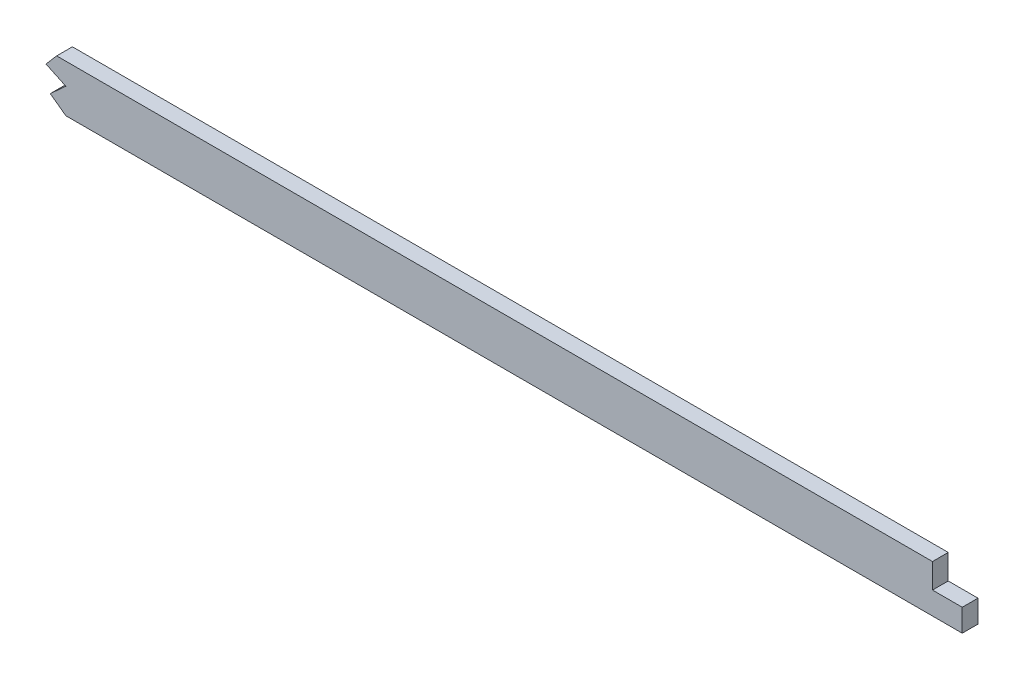
ISO-10303-21;
HEADER;
FILE_DESCRIPTION(('STEP AP214'),'2;1');
FILE_NAME('part.step','',(''),(''),'','','');
FILE_SCHEMA(('AUTOMOTIVE_DESIGN { 1 0 10303 214 1 1 1 1 }'));
ENDSEC;
DATA;
#1=APPLICATION_CONTEXT('core data for automotive mechanical design processes');
#2=APPLICATION_PROTOCOL_DEFINITION('international standard','automotive_design',2000,#1);
#3=PRODUCT_CONTEXT('',#1,'mechanical');
#4=PRODUCT('Part','Part','',(#3));
#5=PRODUCT_RELATED_PRODUCT_CATEGORY('part','',(#4));
#6=PRODUCT_DEFINITION_FORMATION('','',#4);
#7=PRODUCT_DEFINITION_CONTEXT('part definition',#1,'design');
#8=PRODUCT_DEFINITION('design','',#6,#7);
#9=PRODUCT_DEFINITION_SHAPE('','',#8);
#10=(LENGTH_UNIT() NAMED_UNIT(*) SI_UNIT(.MILLI.,.METRE.));
#11=(NAMED_UNIT(*) PLANE_ANGLE_UNIT() SI_UNIT($,.RADIAN.));
#12=(NAMED_UNIT(*) SI_UNIT($,.STERADIAN.) SOLID_ANGLE_UNIT());
#13=UNCERTAINTY_MEASURE_WITH_UNIT(LENGTH_MEASURE(1.E-05),#10,'distance_accuracy_value','');
#14=(GEOMETRIC_REPRESENTATION_CONTEXT(3) GLOBAL_UNCERTAINTY_ASSIGNED_CONTEXT((#13)) GLOBAL_UNIT_ASSIGNED_CONTEXT((#10,
#11,#12)) REPRESENTATION_CONTEXT('',''));
#15=CARTESIAN_POINT('',(0.,0.,0.));
#16=DIRECTION('',(0.,0.,1.));
#17=DIRECTION('',(1.,0.,0.));
#18=AXIS2_PLACEMENT_3D('',#15,#16,#17);
#19=CARTESIAN_POINT('',(2698.48667469404,11.4806601503293,3.175));
#20=CARTESIAN_POINT('',(2691.24737670604,10.9833200828121,3.175));
#21=CARTESIAN_POINT('',(2679.19516047804,10.1655376868452,3.175));
#22=CARTESIAN_POINT('',(2662.27652557768,9.03876140898899,3.175));
#23=CARTESIAN_POINT('',(2635.66628230206,7.2924691456857,3.175));
#24=CARTESIAN_POINT('',(2596.85766552893,4.8260568530791,3.175));
#25=CARTESIAN_POINT('',(2545.72974303923,1.75834409257586,3.175));
#26=CARTESIAN_POINT('',(2494.40530570724,-1.09855523520035,3.175));
#27=CARTESIAN_POINT('',(2451.53302226734,-3.26657329681936,3.175));
#28=CARTESIAN_POINT('',(2417.1983167563,-4.86708361008882,3.175));
#29=CARTESIAN_POINT('',(2391.45707691927,-6.00358923536048,3.175));
#30=CARTESIAN_POINT('',(2365.63473630713,-7.08685458139135,3.175));
#31=CARTESIAN_POINT('',(2339.54628467245,-8.13772994402807,3.175));
#32=CARTESIAN_POINT('',(2313.46613297408,-9.16513837136649,3.175));
#33=CARTESIAN_POINT('',(2287.61237548634,-10.1794782148021,3.175));
#34=CARTESIAN_POINT('',(2261.7633474368,-11.2010322967668,3.175));
#35=CARTESIAN_POINT('',(2227.28532971514,-12.5838425566113,3.175));
#36=CARTESIAN_POINT('',(2184.17556939327,-14.3660723604172,3.175));
#37=CARTESIAN_POINT('',(2132.42906611447,-16.6074278682384,3.175));
#38=CARTESIAN_POINT('',(2063.42552339989,-19.708920484548,3.175));
#39=CARTESIAN_POINT('',(1977.17490763451,-23.7005433130483,3.175));
#40=CARTESIAN_POINT('',(1873.73245143151,-28.149389220677,3.175));
#41=CARTESIAN_POINT('',(1770.37461881016,-31.6574686487852,3.175));
#42=CARTESIAN_POINT('',(1667.08568781321,-33.7931175563218,3.175));
#43=CARTESIAN_POINT('',(1581.01109449057,-34.3831888311612,3.175));
#44=CARTESIAN_POINT('',(1512.07397125959,-34.4278026003723,3.175));
#45=CARTESIAN_POINT('',(1443.06151347714,-34.4095104024296,3.175));
#46=CARTESIAN_POINT('',(1356.80092787913,-34.4244328117572,3.175));
#47=CARTESIAN_POINT('',(1218.79462695393,-34.4184647879491,3.175));
#48=CARTESIAN_POINT('',(1115.28902278569,-34.4207027968771,3.175));
#49=CARTESIAN_POINT('',(1046.28548189005,-34.4207027968771,3.175));
#50=B_SPLINE_CURVE_WITH_KNOTS('',3,(#19,#20,#21,#22,#23,#24,#25,#26,#27,#28,#29,#30,#31,#32,#33,
#34,#35,#36,#37,#38,#39,#40,#41,#42,#43,#44,#45,#46,#47,#48,#49),.UNSPECIFIED.,.F.,.F.,(4,1,1,1,
1,1,1,1,1,1,1,1,1,1,1,1,1,1,1,1,1,1,1,1,1,1,1,1,4),(100.654804519159,102.842388131745,
104.300777206802,105.766098402935,110.877392286712,115.988686170488,121.099980054264,
126.21127393804,128.766920879929,131.322567821817,133.878214763705,136.433861705593,
138.989508647481,141.545155589369,144.100802531257,146.656449473146,151.767743356922,
156.879037240698,161.990331124474,172.212918892027,182.43550665958,192.658094427132,
202.880682194685,213.103269962237,218.214563846014,223.32585772979,233.548445497342,
243.771033264895,264.2162088),.UNSPECIFIED.);
#51=DIRECTION('',(0.,0.,-1.));
#52=VECTOR('',#51,1.);
#53=SURFACE_OF_LINEAR_EXTRUSION('',#50,#52);
#54=CARTESIAN_POINT('',(2698.48667469404,11.4806601503293,-3.175));
#55=CARTESIAN_POINT('',(2691.24737670604,10.9833200828121,-3.175));
#56=CARTESIAN_POINT('',(2679.19516047804,10.1655376868452,-3.175));
#57=CARTESIAN_POINT('',(2662.27652557768,9.03876140898899,-3.175));
#58=CARTESIAN_POINT('',(2635.66628230206,7.2924691456857,-3.175));
#59=CARTESIAN_POINT('',(2596.85766552893,4.8260568530791,-3.175));
#60=CARTESIAN_POINT('',(2545.72974303923,1.75834409257586,-3.175));
#61=CARTESIAN_POINT('',(2494.40530570724,-1.09855523520035,-3.175));
#62=CARTESIAN_POINT('',(2451.53302226734,-3.26657329681936,-3.175));
#63=CARTESIAN_POINT('',(2417.1983167563,-4.86708361008882,-3.175));
#64=CARTESIAN_POINT('',(2391.45707691927,-6.00358923536048,-3.175));
#65=CARTESIAN_POINT('',(2365.63473630713,-7.08685458139135,-3.175));
#66=CARTESIAN_POINT('',(2339.54628467245,-8.13772994402807,-3.175));
#67=CARTESIAN_POINT('',(2313.46613297408,-9.16513837136649,-3.175));
#68=CARTESIAN_POINT('',(2287.61237548634,-10.1794782148021,-3.175));
#69=CARTESIAN_POINT('',(2261.7633474368,-11.2010322967668,-3.175));
#70=CARTESIAN_POINT('',(2227.28532971514,-12.5838425566113,-3.175));
#71=CARTESIAN_POINT('',(2184.17556939327,-14.3660723604172,-3.175));
#72=CARTESIAN_POINT('',(2132.42906611447,-16.6074278682384,-3.175));
#73=CARTESIAN_POINT('',(2063.42552339989,-19.708920484548,-3.175));
#74=CARTESIAN_POINT('',(1977.17490763451,-23.7005433130483,-3.175));
#75=CARTESIAN_POINT('',(1873.73245143151,-28.149389220677,-3.175));
#76=CARTESIAN_POINT('',(1770.37461881016,-31.6574686487852,-3.175));
#77=CARTESIAN_POINT('',(1667.08568781321,-33.7931175563218,-3.175));
#78=CARTESIAN_POINT('',(1581.01109449057,-34.3831888311612,-3.175));
#79=CARTESIAN_POINT('',(1512.07397125959,-34.4278026003723,-3.175));
#80=CARTESIAN_POINT('',(1443.06151347714,-34.4095104024296,-3.175));
#81=CARTESIAN_POINT('',(1356.80092787913,-34.4244328117572,-3.175));
#82=CARTESIAN_POINT('',(1218.79462695393,-34.4184647879491,-3.175));
#83=CARTESIAN_POINT('',(1115.28902278569,-34.4207027968771,-3.175));
#84=CARTESIAN_POINT('',(1046.28548189005,-34.4207027968771,-3.175));
#85=B_SPLINE_CURVE_WITH_KNOTS('',3,(#54,#55,#56,#57,#58,#59,#60,#61,#62,#63,#64,#65,#66,#67,#68,
#69,#70,#71,#72,#73,#74,#75,#76,#77,#78,#79,#80,#81,#82,#83,#84),.UNSPECIFIED.,.F.,.F.,(4,1,1,1,
1,1,1,1,1,1,1,1,1,1,1,1,1,1,1,1,1,1,1,1,1,1,1,1,4),(100.654804519159,102.842388131745,
104.300777206802,105.766098402935,110.877392286712,115.988686170488,121.099980054264,
126.21127393804,128.766920879929,131.322567821817,133.878214763705,136.433861705593,
138.989508647481,141.545155589369,144.100802531257,146.656449473146,151.767743356922,
156.879037240698,161.990331124474,172.212918892027,182.43550665958,192.658094427132,
202.880682194685,213.103269962237,218.214563846014,223.32585772979,233.548445497342,
243.771033264895,264.2162088),.UNSPECIFIED.);
#86=CARTESIAN_POINT('',(1534.52091804462,-34.4089341740227,-3.175));
#87=VERTEX_POINT('',#86);
#88=CARTESIAN_POINT('',(1181.43398343302,-34.4200405248928,-3.175));
#89=VERTEX_POINT('',#88);
#90=EDGE_CURVE('E139',#87,#89,#85,.T.);
#91=ORIENTED_EDGE('',*,*,#90,.T.);
#92=DIRECTION('',(0.,0.,1.));
#93=VECTOR('',#92,1.);
#94=CARTESIAN_POINT('',(1181.43398343302,-34.4200405248928,-4.445));
#95=LINE('',#94,#93);
#96=CARTESIAN_POINT('',(1181.43398343302,-34.4200405248928,3.175));
#97=VERTEX_POINT('',#96);
#98=EDGE_CURVE('E208',#89,#97,#95,.T.);
#99=ORIENTED_EDGE('',*,*,#98,.T.);
#100=CARTESIAN_POINT('',(1534.52091804462,-34.4089341740227,3.175));
#101=VERTEX_POINT('',#100);
#102=EDGE_CURVE('E43',#101,#97,#50,.T.);
#103=ORIENTED_EDGE('',*,*,#102,.F.);
#104=DIRECTION('',(0.,0.,-1.));
#105=VECTOR('',#104,1.);
#106=CARTESIAN_POINT('',(1534.52091804462,-34.4089341740227,3.175));
#107=LINE('',#106,#105);
#108=EDGE_CURVE('E151',#101,#87,#107,.T.);
#109=ORIENTED_EDGE('',*,*,#108,.T.);
#110=EDGE_LOOP('',(#91,#99,#103,#109));
#111=FACE_BOUND('',#110,.T.);
#112=ADVANCED_FACE('F38',(#111),#53,.F.);
#113=CARTESIAN_POINT('',(2699.79233294449,-7.52454325644929,3.175));
#114=CARTESIAN_POINT('',(2639.63682069028,-11.6572294058032,3.175));
#115=CARTESIAN_POINT('',(2579.48130742255,-15.435846921513,3.175));
#116=CARTESIAN_POINT('',(2518.49810546626,-19.1485286488731,3.175));
#117=CARTESIAN_POINT('',(2436.3555443117,-23.2523639114786,3.175));
#118=CARTESIAN_POINT('',(2354.21298315715,-26.6314864233564,3.175));
#119=CARTESIAN_POINT('',(2332.5703304682,-27.4809881692809,3.175));
#120=CARTESIAN_POINT('',(2156.26863942885,-34.3777685431634,3.175));
#121=CARTESIAN_POINT('',(1979.96694737597,-41.6286312484567,3.175));
#122=CARTESIAN_POINT('',(1824.11427763497,-52.7712658766203,3.175));
#123=CARTESIAN_POINT('',(1636.92860677809,-53.5795698486924,3.175));
#124=CARTESIAN_POINT('',(1449.7429359212,-53.4540246131279,3.175));
#125=CARTESIAN_POINT('',(1418.00673093479,-53.4707027968771,3.175));
#126=CARTESIAN_POINT('',(1324.89933614602,-53.4707027968771,3.175));
#127=CARTESIAN_POINT('',(1231.79194034372,-53.4707027968771,3.175));
#128=CARTESIAN_POINT('',(1170.4412693194,-53.4707027968771,3.175));
#129=CARTESIAN_POINT('',(1108.78407581299,-53.4707027968771,3.175));
#130=CARTESIAN_POINT('',(1047.12688234629,-53.4707027968771,3.175));
#131=CARTESIAN_POINT('',(1046.84641418849,-53.4707027968771,3.175));
#132=CARTESIAN_POINT('',(1046.56594718406,-53.4707027968771,3.175));
#133=CARTESIAN_POINT('',(1046.28548189005,-53.4707027968771,3.175));
#134=(BOUNDED_CURVE() B_SPLINE_CURVE(5,(#113,#114,#115,#116,#117,#118,#119,#120,#121,#122,#123,
#124,#125,#126,#127,#128,#129,#130,#131,#132,#133),.UNSPECIFIED.,.F.,
.F.) B_SPLINE_CURVE_WITH_KNOTS((6,3,3,3,3,3,6),(100.654804519159,130.927896619159,
141.337054719159,218.101815019159,233.772059419159,264.077723219159,264.2162088),
.UNSPECIFIED.) CURVE() GEOMETRIC_REPRESENTATION_ITEM() RATIONAL_B_SPLINE_CURVE((1.,1.,1.,1.,1.,
1.,1.,1.,1.,1.,1.,1.,1.,1.,1.,1.,1.,1.,1.,1.,1.)) REPRESENTATION_ITEM(''));
#135=DIRECTION('',(0.,0.,-1.));
#136=VECTOR('',#135,1.);
#137=SURFACE_OF_LINEAR_EXTRUSION('',#134,#136);
#138=DIRECTION('',(0.,0.,1.));
#139=VECTOR('',#138,1.);
#140=CARTESIAN_POINT('',(1185.13596806479,-53.4707027968771,-4.445));
#141=LINE('',#140,#139);
#142=CARTESIAN_POINT('',(1185.13596806479,-53.4707027968771,-3.175));
#143=VERTEX_POINT('',#142);
#144=CARTESIAN_POINT('',(1185.13596806479,-53.4707027968771,3.175));
#145=VERTEX_POINT('',#144);
#146=EDGE_CURVE('E111',#143,#145,#141,.T.);
#147=ORIENTED_EDGE('',*,*,#146,.F.);
#148=CARTESIAN_POINT('',(2699.79233294449,-7.52454325644929,-3.175));
#149=CARTESIAN_POINT('',(2639.63682069028,-11.6572294058032,-3.175));
#150=CARTESIAN_POINT('',(2579.48130742255,-15.435846921513,-3.175));
#151=CARTESIAN_POINT('',(2518.49810546626,-19.1485286488731,-3.175));
#152=CARTESIAN_POINT('',(2436.3555443117,-23.2523639114786,-3.175));
#153=CARTESIAN_POINT('',(2354.21298315715,-26.6314864233564,-3.175));
#154=CARTESIAN_POINT('',(2332.5703304682,-27.4809881692809,-3.175));
#155=CARTESIAN_POINT('',(2156.26863942885,-34.3777685431634,-3.175));
#156=CARTESIAN_POINT('',(1979.96694737597,-41.6286312484567,-3.175));
#157=CARTESIAN_POINT('',(1824.11427763497,-52.7712658766203,-3.175));
#158=CARTESIAN_POINT('',(1636.92860677809,-53.5795698486924,-3.175));
#159=CARTESIAN_POINT('',(1449.7429359212,-53.4540246131279,-3.175));
#160=CARTESIAN_POINT('',(1418.00673093479,-53.4707027968771,-3.175));
#161=CARTESIAN_POINT('',(1324.89933614602,-53.4707027968771,-3.175));
#162=CARTESIAN_POINT('',(1231.79194034372,-53.4707027968771,-3.175));
#163=CARTESIAN_POINT('',(1170.4412693194,-53.4707027968771,-3.175));
#164=CARTESIAN_POINT('',(1108.78407581299,-53.4707027968771,-3.175));
#165=CARTESIAN_POINT('',(1047.12688234629,-53.4707027968771,-3.175));
#166=CARTESIAN_POINT('',(1046.84641418849,-53.4707027968771,-3.175));
#167=CARTESIAN_POINT('',(1046.56594718406,-53.4707027968771,-3.175));
#168=CARTESIAN_POINT('',(1046.28548189005,-53.4707027968771,-3.175));
#169=(BOUNDED_CURVE() B_SPLINE_CURVE(5,(#148,#149,#150,#151,#152,#153,#154,#155,#156,#157,#158,
#159,#160,#161,#162,#163,#164,#165,#166,#167,#168),.UNSPECIFIED.,.F.,
.F.) B_SPLINE_CURVE_WITH_KNOTS((6,3,3,3,3,3,6),(100.654804519159,130.927896619159,
141.337054719159,218.101815019159,233.772059419159,264.077723219159,264.2162088),
.UNSPECIFIED.) CURVE() GEOMETRIC_REPRESENTATION_ITEM() RATIONAL_B_SPLINE_CURVE((1.,1.,1.,1.,1.,
1.,1.,1.,1.,1.,1.,1.,1.,1.,1.,1.,1.,1.,1.,1.,1.)) REPRESENTATION_ITEM(''));
#170=CARTESIAN_POINT('',(1546.51800256354,-53.4447763745865,-3.175));
#171=VERTEX_POINT('',#170);
#172=EDGE_CURVE('E145',#171,#143,#169,.T.);
#173=ORIENTED_EDGE('',*,*,#172,.F.);
#174=DIRECTION('',(0.,0.,1.));
#175=VECTOR('',#174,1.);
#176=CARTESIAN_POINT('',(1546.51800256354,-53.4447763745865,-4.445));
#177=LINE('',#176,#175);
#178=CARTESIAN_POINT('',(1546.51800256354,-53.4447763745865,3.175));
#179=VERTEX_POINT('',#178);
#180=EDGE_CURVE('E135',#171,#179,#177,.T.);
#181=ORIENTED_EDGE('',*,*,#180,.T.);
#182=EDGE_CURVE('E130',#179,#145,#134,.T.);
#183=ORIENTED_EDGE('',*,*,#182,.T.);
#184=EDGE_LOOP('',(#147,#173,#181,#183));
#185=FACE_BOUND('',#184,.T.);
#186=ADVANCED_FACE('F40',(#185),#137,.T.);
#187=CARTESIAN_POINT('',(0.,0.,3.175));
#188=DIRECTION('',(0.,0.,1.));
#189=DIRECTION('',(1.,0.,0.));
#190=AXIS2_PLACEMENT_3D('',#187,#188,#189);
#191=PLANE('',#190);
#192=DIRECTION('',(0.652503967761315,0.757785307363333,0.));
#193=VECTOR('',#192,1.);
#194=CARTESIAN_POINT('',(1181.43398343302,-34.4200405248928,3.175));
#195=LINE('',#194,#193);
#196=CARTESIAN_POINT('',(1177.13638245826,-39.4110582603955,3.175));
#197=VERTEX_POINT('',#196);
#198=EDGE_CURVE('E123',#197,#97,#195,.T.);
#199=ORIENTED_EDGE('',*,*,#198,.F.);
#200=DIRECTION('',(-0.905436783134564,0.424481132380383,0.));
#201=VECTOR('',#200,1.);
#202=CARTESIAN_POINT('',(1177.13638245826,-39.4110582603955,3.175));
#203=LINE('',#202,#201);
#204=CARTESIAN_POINT('',(1185.13596806479,-43.1613732686698,3.175));
#205=VERTEX_POINT('',#204);
#206=EDGE_CURVE('E211',#205,#197,#203,.T.);
#207=ORIENTED_EDGE('',*,*,#206,.F.);
#208=DIRECTION('',(0.73933586722595,0.673336821682323,0.));
#209=VECTOR('',#208,1.);
#210=CARTESIAN_POINT('',(1185.13596806479,-43.1613732686698,3.175));
#211=LINE('',#210,#209);
#212=CARTESIAN_POINT('',(1178.85783852763,-48.8790666419403,3.175));
#213=VERTEX_POINT('',#212);
#214=EDGE_CURVE('E133',#213,#205,#211,.T.);
#215=ORIENTED_EDGE('',*,*,#214,.F.);
#216=DIRECTION('',(-0.807160024463634,0.59033269849117,0.));
#217=VECTOR('',#216,1.);
#218=CARTESIAN_POINT('',(1178.85783852763,-48.8790666419403,3.175));
#219=LINE('',#218,#217);
#220=EDGE_CURVE('E114',#145,#213,#219,.T.);
#221=ORIENTED_EDGE('',*,*,#220,.F.);
#222=ORIENTED_EDGE('',*,*,#182,.F.);
#223=DIRECTION('',(0.,-1.,0.));
#224=VECTOR('',#223,1.);
#225=CARTESIAN_POINT('',(1546.51800256354,-44.3802226943777,3.175));
#226=LINE('',#225,#224);
#227=CARTESIAN_POINT('',(1546.51800256354,-44.3802226943777,3.175));
#228=VERTEX_POINT('',#227);
#229=EDGE_CURVE('E234',#228,#179,#226,.T.);
#230=ORIENTED_EDGE('',*,*,#229,.F.);
#231=DIRECTION('',(1.,0.,0.));
#232=VECTOR('',#231,1.);
#233=CARTESIAN_POINT('',(1534.52091804462,-44.3802226943777,3.175));
#234=LINE('',#233,#232);
#235=CARTESIAN_POINT('',(1534.52091804462,-44.3802226943777,3.175));
#236=VERTEX_POINT('',#235);
#237=EDGE_CURVE('E230',#236,#228,#234,.T.);
#238=ORIENTED_EDGE('',*,*,#237,.F.);
#239=DIRECTION('',(0.,-1.,0.));
#240=VECTOR('',#239,1.);
#241=CARTESIAN_POINT('',(1534.52091804462,-34.4089341740227,3.175));
#242=LINE('',#241,#240);
#243=EDGE_CURVE('E227',#101,#236,#242,.T.);
#244=ORIENTED_EDGE('',*,*,#243,.F.);
#245=ORIENTED_EDGE('',*,*,#102,.T.);
#246=EDGE_LOOP('',(#199,#207,#215,#221,#222,#230,#238,#244,#245));
#247=FACE_BOUND('',#246,.T.);
#248=ADVANCED_FACE('F128',(#247),#191,.T.);
#249=CARTESIAN_POINT('',(0.,0.,-3.175));
#250=DIRECTION('',(0.,0.,1.));
#251=DIRECTION('',(1.,0.,0.));
#252=AXIS2_PLACEMENT_3D('',#249,#250,#251);
#253=PLANE('',#252);
#254=DIRECTION('',(-0.905436783134564,0.424481132380383,0.));
#255=VECTOR('',#254,1.);
#256=CARTESIAN_POINT('',(196.954135852065,420.111768433416,-3.175));
#257=LINE('',#256,#255);
#258=CARTESIAN_POINT('',(1185.13596806479,-43.1613732686698,-3.175));
#259=VERTEX_POINT('',#258);
#260=CARTESIAN_POINT('',(1177.13638245826,-39.4110582603955,-3.175));
#261=VERTEX_POINT('',#260);
#262=EDGE_CURVE('E50',#259,#261,#257,.T.);
#263=ORIENTED_EDGE('',*,*,#262,.T.);
#264=DIRECTION('',(0.652503967761315,0.757785307363333,0.));
#265=VECTOR('',#264,1.);
#266=CARTESIAN_POINT('',(695.444225260897,-598.824115392695,-3.175));
#267=LINE('',#266,#265);
#268=EDGE_CURVE('E11',#261,#89,#267,.T.);
#269=ORIENTED_EDGE('',*,*,#268,.T.);
#270=ORIENTED_EDGE('',*,*,#90,.F.);
#271=DIRECTION('',(0.,-1.,0.));
#272=VECTOR('',#271,1.);
#273=CARTESIAN_POINT('',(1534.52091804462,0.,-3.175));
#274=LINE('',#273,#272);
#275=CARTESIAN_POINT('',(1534.52091804462,-44.3802226943777,-3.175));
#276=VERTEX_POINT('',#275);
#277=EDGE_CURVE('E143',#87,#276,#274,.T.);
#278=ORIENTED_EDGE('',*,*,#277,.T.);
#279=DIRECTION('',(1.,0.,0.));
#280=VECTOR('',#279,1.);
#281=CARTESIAN_POINT('',(0.,-44.3802226943777,-3.175));
#282=LINE('',#281,#280);
#283=CARTESIAN_POINT('',(1546.51800256354,-44.3802226943777,-3.175));
#284=VERTEX_POINT('',#283);
#285=EDGE_CURVE('E245',#276,#284,#282,.T.);
#286=ORIENTED_EDGE('',*,*,#285,.T.);
#287=DIRECTION('',(0.,-1.,0.));
#288=VECTOR('',#287,1.);
#289=CARTESIAN_POINT('',(1546.51800256354,0.,-3.175));
#290=LINE('',#289,#288);
#291=EDGE_CURVE('E249',#284,#171,#290,.T.);
#292=ORIENTED_EDGE('',*,*,#291,.T.);
#293=ORIENTED_EDGE('',*,*,#172,.T.);
#294=DIRECTION('',(-0.807160024463634,0.59033269849117,0.));
#295=VECTOR('',#294,1.);
#296=CARTESIAN_POINT('',(387.532814142506,529.872386441092,-3.175));
#297=LINE('',#296,#295);
#298=CARTESIAN_POINT('',(1178.85783852763,-48.8790666419404,-3.175));
#299=VERTEX_POINT('',#298);
#300=EDGE_CURVE('E117',#143,#299,#297,.T.);
#301=ORIENTED_EDGE('',*,*,#300,.T.);
#302=DIRECTION('',(0.73933586722595,0.673336821682323,0.));
#303=VECTOR('',#302,1.);
#304=CARTESIAN_POINT('',(558.806562808448,-613.579595563031,-3.175));
#305=LINE('',#304,#303);
#306=EDGE_CURVE('E260',#299,#259,#305,.T.);
#307=ORIENTED_EDGE('',*,*,#306,.T.);
#308=EDGE_LOOP('',(#263,#269,#270,#278,#286,#292,#293,#301,#307));
#309=FACE_BOUND('',#308,.T.);
#310=ADVANCED_FACE('F170',(#309),#253,.F.);
#311=CARTESIAN_POINT('',(1546.51800256354,-44.3802226943777,-4.445));
#312=DIRECTION('',(-1.,0.,0.));
#313=DIRECTION('',(0.,0.,1.));
#314=AXIS2_PLACEMENT_3D('',#311,#312,#313);
#315=PLANE('',#314);
#316=DIRECTION('',(0.,0.,1.));
#317=VECTOR('',#316,1.);
#318=CARTESIAN_POINT('',(1546.51800256354,-44.3802226943777,-4.445));
#319=LINE('',#318,#317);
#320=EDGE_CURVE('E239',#284,#228,#319,.T.);
#321=ORIENTED_EDGE('',*,*,#320,.T.);
#322=ORIENTED_EDGE('',*,*,#229,.T.);
#323=ORIENTED_EDGE('',*,*,#180,.F.);
#324=ORIENTED_EDGE('',*,*,#291,.F.);
#325=EDGE_LOOP('',(#321,#322,#323,#324));
#326=FACE_BOUND('',#325,.T.);
#327=ADVANCED_FACE('F173',(#326),#315,.F.);
#328=CARTESIAN_POINT('',(1534.52091804462,-44.3802226943777,-4.445));
#329=DIRECTION('',(0.,-1.,0.));
#330=DIRECTION('',(0.,0.,-1.));
#331=AXIS2_PLACEMENT_3D('',#328,#329,#330);
#332=PLANE('',#331);
#333=DIRECTION('',(0.,0.,1.));
#334=VECTOR('',#333,1.);
#335=CARTESIAN_POINT('',(1534.52091804462,-44.3802226943777,-4.445));
#336=LINE('',#335,#334);
#337=EDGE_CURVE('E65',#276,#236,#336,.T.);
#338=ORIENTED_EDGE('',*,*,#337,.T.);
#339=ORIENTED_EDGE('',*,*,#237,.T.);
#340=ORIENTED_EDGE('',*,*,#320,.F.);
#341=ORIENTED_EDGE('',*,*,#285,.F.);
#342=EDGE_LOOP('',(#338,#339,#340,#341));
#343=FACE_BOUND('',#342,.T.);
#344=ADVANCED_FACE('F181',(#343),#332,.F.);
#345=CARTESIAN_POINT('',(1534.52091804462,-34.4089341740227,-4.445));
#346=DIRECTION('',(-1.,0.,0.));
#347=DIRECTION('',(0.,0.,1.));
#348=AXIS2_PLACEMENT_3D('',#345,#346,#347);
#349=PLANE('',#348);
#350=ORIENTED_EDGE('',*,*,#243,.T.);
#351=ORIENTED_EDGE('',*,*,#337,.F.);
#352=ORIENTED_EDGE('',*,*,#277,.F.);
#353=ORIENTED_EDGE('',*,*,#108,.F.);
#354=EDGE_LOOP('',(#350,#351,#352,#353));
#355=FACE_BOUND('',#354,.T.);
#356=ADVANCED_FACE('F177',(#355),#349,.F.);
#357=CARTESIAN_POINT('',(1181.43398343302,-34.4200405248928,-4.445));
#358=DIRECTION('',(0.757785307363333,-0.652503967761315,0.));
#359=DIRECTION('',(0.652503967761315,0.757785307363333,0.));
#360=AXIS2_PLACEMENT_3D('',#357,#358,#359);
#361=PLANE('',#360);
#362=DIRECTION('',(0.,0.,1.));
#363=VECTOR('',#362,1.);
#364=CARTESIAN_POINT('',(1177.13638245826,-39.4110582603955,-4.445));
#365=LINE('',#364,#363);
#366=EDGE_CURVE('E203',#261,#197,#365,.T.);
#367=ORIENTED_EDGE('',*,*,#366,.T.);
#368=ORIENTED_EDGE('',*,*,#198,.T.);
#369=ORIENTED_EDGE('',*,*,#98,.F.);
#370=ORIENTED_EDGE('',*,*,#268,.F.);
#371=EDGE_LOOP('',(#367,#368,#369,#370));
#372=FACE_BOUND('',#371,.T.);
#373=ADVANCED_FACE('F180',(#372),#361,.F.);
#374=CARTESIAN_POINT('',(1177.13638245826,-39.4110582603955,-4.445));
#375=DIRECTION('',(0.424481132380383,0.905436783134564,0.));
#376=DIRECTION('',(-0.905436783134564,0.424481132380383,0.));
#377=AXIS2_PLACEMENT_3D('',#374,#375,#376);
#378=PLANE('',#377);
#379=DIRECTION('',(0.,0.,1.));
#380=VECTOR('',#379,1.);
#381=CARTESIAN_POINT('',(1185.13596806479,-43.1613732686698,-4.445));
#382=LINE('',#381,#380);
#383=EDGE_CURVE('E209',#259,#205,#382,.T.);
#384=ORIENTED_EDGE('',*,*,#383,.T.);
#385=ORIENTED_EDGE('',*,*,#206,.T.);
#386=ORIENTED_EDGE('',*,*,#366,.F.);
#387=ORIENTED_EDGE('',*,*,#262,.F.);
#388=EDGE_LOOP('',(#384,#385,#386,#387));
#389=FACE_BOUND('',#388,.T.);
#390=ADVANCED_FACE('F193',(#389),#378,.F.);
#391=CARTESIAN_POINT('',(1185.13596806479,-43.1613732686698,-4.445));
#392=DIRECTION('',(0.673336821682323,-0.73933586722595,0.));
#393=DIRECTION('',(0.73933586722595,0.673336821682323,0.));
#394=AXIS2_PLACEMENT_3D('',#391,#392,#393);
#395=PLANE('',#394);
#396=DIRECTION('',(0.,0.,1.));
#397=VECTOR('',#396,1.);
#398=CARTESIAN_POINT('',(1178.85783852763,-48.8790666419403,-4.445));
#399=LINE('',#398,#397);
#400=EDGE_CURVE('E57',#299,#213,#399,.T.);
#401=ORIENTED_EDGE('',*,*,#400,.T.);
#402=ORIENTED_EDGE('',*,*,#214,.T.);
#403=ORIENTED_EDGE('',*,*,#383,.F.);
#404=ORIENTED_EDGE('',*,*,#306,.F.);
#405=EDGE_LOOP('',(#401,#402,#403,#404));
#406=FACE_BOUND('',#405,.T.);
#407=ADVANCED_FACE('F190',(#406),#395,.F.);
#408=CARTESIAN_POINT('',(1178.85783852763,-48.8790666419403,-4.445));
#409=DIRECTION('',(0.59033269849117,0.807160024463634,0.));
#410=DIRECTION('',(-0.807160024463634,0.59033269849117,0.));
#411=AXIS2_PLACEMENT_3D('',#408,#409,#410);
#412=PLANE('',#411);
#413=ORIENTED_EDGE('',*,*,#146,.T.);
#414=ORIENTED_EDGE('',*,*,#220,.T.);
#415=ORIENTED_EDGE('',*,*,#400,.F.);
#416=ORIENTED_EDGE('',*,*,#300,.F.);
#417=EDGE_LOOP('',(#413,#414,#415,#416));
#418=FACE_BOUND('',#417,.T.);
#419=ADVANCED_FACE('F113',(#418),#412,.F.);
#420=CLOSED_SHELL('',(#112,#186,#248,#310,#327,#344,#356,#373,#390,#407,#419));
#421=MANIFOLD_SOLID_BREP('B2',#420);
#422=ADVANCED_BREP_SHAPE_REPRESENTATION('',(#18,#421),#14);
#423=SHAPE_DEFINITION_REPRESENTATION(#9,#422);
ENDSEC;
END-ISO-10303-21;
